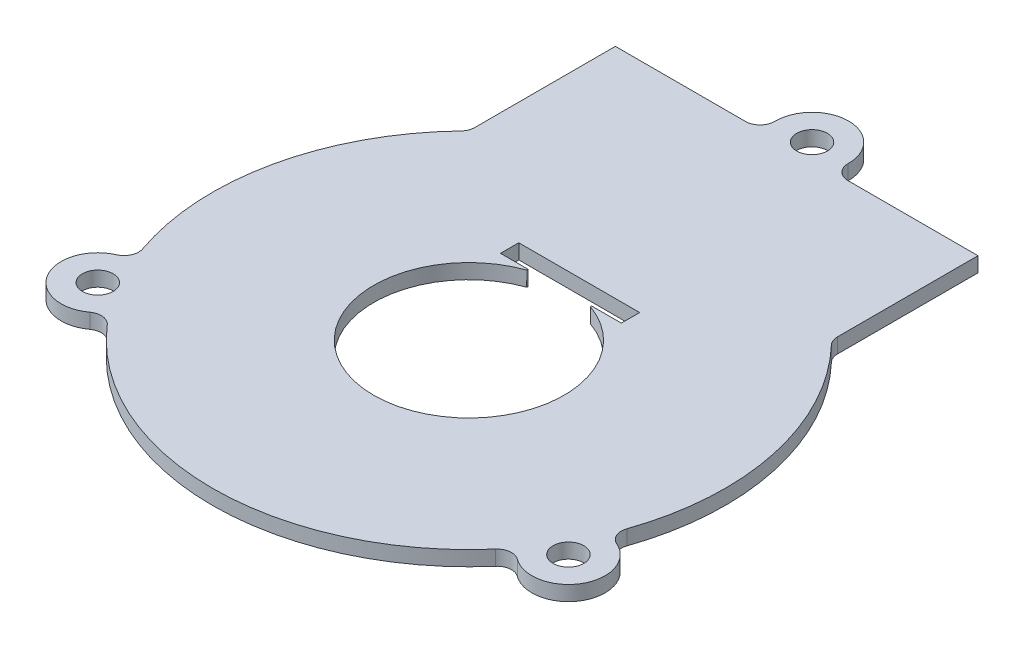
ISO-10303-21;
HEADER;
FILE_DESCRIPTION(('STEP AP214'),'2;1');
FILE_NAME('part.step','',(''),(''),'','','');
FILE_SCHEMA(('AUTOMOTIVE_DESIGN { 1 0 10303 214 1 1 1 1 }'));
ENDSEC;
DATA;
#1=APPLICATION_CONTEXT('core data for automotive mechanical design processes');
#2=APPLICATION_PROTOCOL_DEFINITION('international standard','automotive_design',2000,#1);
#3=PRODUCT_CONTEXT('',#1,'mechanical');
#4=PRODUCT('Part','Part','',(#3));
#5=PRODUCT_RELATED_PRODUCT_CATEGORY('part','',(#4));
#6=PRODUCT_DEFINITION_FORMATION('','',#4);
#7=PRODUCT_DEFINITION_CONTEXT('part definition',#1,'design');
#8=PRODUCT_DEFINITION('design','',#6,#7);
#9=PRODUCT_DEFINITION_SHAPE('','',#8);
#10=(LENGTH_UNIT() NAMED_UNIT(*) SI_UNIT(.MILLI.,.METRE.));
#11=(NAMED_UNIT(*) PLANE_ANGLE_UNIT() SI_UNIT($,.RADIAN.));
#12=(NAMED_UNIT(*) SI_UNIT($,.STERADIAN.) SOLID_ANGLE_UNIT());
#13=UNCERTAINTY_MEASURE_WITH_UNIT(LENGTH_MEASURE(1.E-05),#10,'distance_accuracy_value','');
#14=(GEOMETRIC_REPRESENTATION_CONTEXT(3) GLOBAL_UNCERTAINTY_ASSIGNED_CONTEXT((#13)) GLOBAL_UNIT_ASSIGNED_CONTEXT((#10,
#11,#12)) REPRESENTATION_CONTEXT('',''));
#15=CARTESIAN_POINT('',(0.,0.,0.));
#16=DIRECTION('',(0.,0.,1.));
#17=DIRECTION('',(1.,0.,0.));
#18=AXIS2_PLACEMENT_3D('',#15,#16,#17);
#19=CARTESIAN_POINT('',(0.,2.032,0.));
#20=DIRECTION('',(0.,1.,0.));
#21=DIRECTION('',(0.,0.,1.));
#22=AXIS2_PLACEMENT_3D('',#19,#20,#21);
#23=PLANE('',#22);
#24=CARTESIAN_POINT('',(-32.1480166138315,2.032,18.5087961651664));
#25=DIRECTION('',(0.,1.,0.));
#26=DIRECTION('',(0.,0.,1.));
#27=AXIS2_PLACEMENT_3D('',#24,#25,#26);
#28=CIRCLE('',#27,2.09999999999999);
#29=CARTESIAN_POINT('',(-32.1480166138315,2.032,20.6087961651664));
#30=VERTEX_POINT('',#29);
#31=EDGE_CURVE('E260',#30,#30,#28,.T.);
#32=ORIENTED_EDGE('',*,*,#31,.F.);
#33=EDGE_LOOP('',(#32));
#34=FACE_BOUND('',#33,.T.);
#35=DIRECTION('',(-3.02063810260161E-06,0.,-0.999999999995438));
#36=VECTOR('',#35,1.);
#37=CARTESIAN_POINT('',(-24.7478001128037,2.032,-24.7496745347634));
#38=LINE('',#37,#36);
#39=CARTESIAN_POINT('',(-24.7478025747881,2.032,-25.5647289504072));
#40=VERTEX_POINT('',#39);
#41=CARTESIAN_POINT('',(-24.7478605121482,2.032,-44.7452325826062));
#42=VERTEX_POINT('',#41);
#43=EDGE_CURVE('E309',#40,#42,#38,.T.);
#44=ORIENTED_EDGE('',*,*,#43,.F.);
#45=CARTESIAN_POINT('',(-26.747802574779,2.032,-25.564722909131));
#46=DIRECTION('',(0.,1.,0.));
#47=DIRECTION('',(0.,0.,1.));
#48=AXIS2_PLACEMENT_3D('',#45,#46,#47);
#49=CIRCLE('',#48,2.);
#50=CARTESIAN_POINT('',(-25.3019754085747,2.032,-24.1828459951239));
#51=VERTEX_POINT('',#50);
#52=EDGE_CURVE('E334',#40,#51,#49,.F.);
#53=ORIENTED_EDGE('',*,*,#52,.T.);
#54=CARTESIAN_POINT('',(0.,2.032,0.));
#55=DIRECTION('',(0.,1.,0.));
#56=DIRECTION('',(0.,0.,1.));
#57=AXIS2_PLACEMENT_3D('',#54,#55,#56);
#58=CIRCLE('',#57,35.);
#59=CARTESIAN_POINT('',(-33.072840065109,2.032,11.4537002766671));
#60=VERTEX_POINT('',#59);
#61=EDGE_CURVE('E320',#51,#60,#58,.T.);
#62=ORIENTED_EDGE('',*,*,#61,.T.);
#63=CARTESIAN_POINT('',(-34.9627166402581,2.032,12.1081974353338));
#64=DIRECTION('',(0.,1.,0.));
#65=DIRECTION('',(0.,0.,1.));
#66=AXIS2_PLACEMENT_3D('',#63,#64,#65);
#67=CIRCLE('',#66,2.);
#68=CARTESIAN_POINT('',(-34.1580179965192,2.032,13.9391698799011));
#69=VERTEX_POINT('',#68);
#70=EDGE_CURVE('E344',#60,#69,#67,.F.);
#71=ORIENTED_EDGE('',*,*,#70,.T.);
#72=CARTESIAN_POINT('',(-32.1464555555357,2.032,18.5161819435163));
#73=DIRECTION('',(0.,1.,0.));
#74=DIRECTION('',(0.,0.,1.));
#75=AXIS2_PLACEMENT_3D('',#72,#73,#74);
#76=CIRCLE('',#75,4.99954226749351);
#77=CARTESIAN_POINT('',(-29.1966357044392,2.032,22.5527628891349));
#78=VERTEX_POINT('',#77);
#79=EDGE_CURVE('E266',#69,#78,#76,.T.);
#80=ORIENTED_EDGE('',*,*,#79,.T.);
#81=CARTESIAN_POINT('',(-28.0165997358363,2.032,24.1675430948605));
#82=DIRECTION('',(0.,1.,0.));
#83=DIRECTION('',(0.,0.,1.));
#84=AXIS2_PLACEMENT_3D('',#81,#82,#83);
#85=CIRCLE('',#84,2.);
#86=CARTESIAN_POINT('',(-26.5021889393046,2.032,22.8611894140572));
#87=VERTEX_POINT('',#86);
#88=EDGE_CURVE('E355',#78,#87,#85,.F.);
#89=ORIENTED_EDGE('',*,*,#88,.T.);
#90=CARTESIAN_POINT('',(26.4887144081727,2.032,22.8768006723464));
#91=VERTEX_POINT('',#90);
#92=EDGE_CURVE('E324',#87,#91,#58,.T.);
#93=ORIENTED_EDGE('',*,*,#92,.T.);
#94=CARTESIAN_POINT('',(28.0023552314968,2.032,24.1840464250519));
#95=DIRECTION('',(0.,1.,0.));
#96=DIRECTION('',(0.,0.,1.));
#97=AXIS2_PLACEMENT_3D('',#94,#95,#96);
#98=CIRCLE('',#97,2.);
#99=CARTESIAN_POINT('',(29.184359284545,2.032,22.5707062815676));
#100=VERTEX_POINT('',#99);
#101=EDGE_CURVE('E363',#91,#100,#98,.F.);
#102=ORIENTED_EDGE('',*,*,#101,.T.);
#103=CARTESIAN_POINT('',(32.1364886347761,2.032,18.5412879583363));
#104=DIRECTION('',(0.,1.,0.));
#105=DIRECTION('',(0.,0.,1.));
#106=AXIS2_PLACEMENT_3D('',#103,#104,#105);
#107=CIRCLE('',#106,4.9951255964279);
#108=CARTESIAN_POINT('',(34.147287178261,2.032,13.9687647007018));
#109=VERTEX_POINT('',#108);
#110=EDGE_CURVE('E277',#100,#109,#107,.T.);
#111=ORIENTED_EDGE('',*,*,#110,.T.);
#112=CARTESIAN_POINT('',(34.9523914763083,2.032,12.1379705917791));
#113=DIRECTION('',(0.,1.,0.));
#114=DIRECTION('',(0.,0.,1.));
#115=AXIS2_PLACEMENT_3D('',#112,#113,#114);
#116=CIRCLE('',#115,2.);
#117=CARTESIAN_POINT('',(33.0630730181294,2.032,11.4818640733046));
#118=VERTEX_POINT('',#117);
#119=EDGE_CURVE('E374',#109,#118,#116,.F.);
#120=ORIENTED_EDGE('',*,*,#119,.T.);
#121=CARTESIAN_POINT('',(25.3018293128609,2.032,-24.1829988509046));
#122=VERTEX_POINT('',#121);
#123=EDGE_CURVE('E325',#118,#122,#58,.T.);
#124=ORIENTED_EDGE('',*,*,#123,.T.);
#125=CARTESIAN_POINT('',(26.7476481307387,2.032,-25.5648844995277));
#126=DIRECTION('',(0.,1.,0.));
#127=DIRECTION('',(0.,0.,1.));
#128=AXIS2_PLACEMENT_3D('',#125,#126,#127);
#129=CIRCLE('',#128,2.);
#130=CARTESIAN_POINT('',(24.7476481307478,2.032,-25.5648784582515));
#131=VERTEX_POINT('',#130);
#132=EDGE_CURVE('E381',#122,#131,#129,.F.);
#133=ORIENTED_EDGE('',*,*,#132,.T.);
#134=DIRECTION('',(-3.02063810260161E-06,0.,-0.999999999995438));
#135=VECTOR('',#134,1.);
#136=CARTESIAN_POINT('',(24.7476505927322,2.032,-24.7498240426077));
#137=LINE('',#136,#135);
#138=CARTESIAN_POINT('',(24.7475901933877,2.032,-44.7453820904505));
#139=VERTEX_POINT('',#138);
#140=EDGE_CURVE('E292',#131,#139,#137,.T.);
#141=ORIENTED_EDGE('',*,*,#140,.T.);
#142=DIRECTION('',(0.999999999995438,0.,-3.0206381024394E-06));
#143=VECTOR('',#142,1.);
#144=CARTESIAN_POINT('',(-24.7478605121482,2.032,-44.7452325826062));
#145=LINE('',#144,#143);
#146=CARTESIAN_POINT('',(6.99533660471705,2.032,-44.7453284673169));
#147=VERTEX_POINT('',#146);
#148=EDGE_CURVE('E305',#147,#139,#145,.T.);
#149=ORIENTED_EDGE('',*,*,#148,.F.);
#150=CARTESIAN_POINT('',(6.99533056344084,2.032,-46.7453284673078));
#151=DIRECTION('',(0.,1.,0.));
#152=DIRECTION('',(0.,0.,1.));
#153=AXIS2_PLACEMENT_3D('',#150,#151,#152);
#154=CIRCLE('',#153,2.);
#155=CARTESIAN_POINT('',(4.99551899083441,2.032,-46.7727815922561));
#156=VERTEX_POINT('',#155);
#157=EDGE_CURVE('E390',#147,#156,#154,.F.);
#158=ORIENTED_EDGE('',*,*,#157,.T.);
#159=CARTESIAN_POINT('',(0.,2.032,-46.8413593567393));
#160=DIRECTION('',(0.,1.,0.));
#161=DIRECTION('',(0.,0.,1.));
#162=AXIS2_PLACEMENT_3D('',#159,#160,#161);
#163=CIRCLE('',#162,4.99598968149142);
#164=CARTESIAN_POINT('',(-4.99551857644603,2.032,-46.7727514129473));
#165=VERTEX_POINT('',#164);
#166=EDGE_CURVE('E286',#156,#165,#163,.T.);
#167=ORIENTED_EDGE('',*,*,#166,.T.);
#168=CARTESIAN_POINT('',(-6.99532998316405,2.032,-46.7452862065854));
#169=DIRECTION('',(0.,1.,0.));
#170=DIRECTION('',(0.,0.,1.));
#171=AXIS2_PLACEMENT_3D('',#168,#169,#170);
#172=CIRCLE('',#171,2.);
#173=CARTESIAN_POINT('',(-6.99532394188785,2.032,-44.7452862065945));
#174=VERTEX_POINT('',#173);
#175=EDGE_CURVE('E401',#165,#174,#172,.F.);
#176=ORIENTED_EDGE('',*,*,#175,.T.);
#177=EDGE_CURVE('E306',#42,#174,#145,.T.);
#178=ORIENTED_EDGE('',*,*,#177,.F.);
#179=EDGE_LOOP('',(#44,#53,#62,#71,#80,#89,#93,#102,#111,#120,#124,#133,#141,#149,#158,#167,
#176,#178));
#180=FACE_BOUND('',#179,.T.);
#181=CARTESIAN_POINT('',(32.1247811991366,2.032,18.5356173256723));
#182=DIRECTION('',(0.,1.,0.));
#183=DIRECTION('',(0.,0.,1.));
#184=AXIS2_PLACEMENT_3D('',#181,#182,#183);
#185=CIRCLE('',#184,2.1);
#186=CARTESIAN_POINT('',(32.1247811991366,2.032,20.6356173256723));
#187=VERTEX_POINT('',#186);
#188=EDGE_CURVE('E271',#187,#187,#185,.T.);
#189=ORIENTED_EDGE('',*,*,#188,.F.);
#190=EDGE_LOOP('',(#189));
#191=FACE_BOUND('',#190,.T.);
#192=CARTESIAN_POINT('',(0.,2.032,-46.8413593567393));
#193=DIRECTION('',(0.,1.,0.));
#194=DIRECTION('',(0.,0.,1.));
#195=AXIS2_PLACEMENT_3D('',#192,#193,#194);
#196=CIRCLE('',#195,2.09605202456873);
#197=CARTESIAN_POINT('',(0.,2.032,-44.7453073321706));
#198=VERTEX_POINT('',#197);
#199=EDGE_CURVE('E282',#198,#198,#196,.T.);
#200=ORIENTED_EDGE('',*,*,#199,.F.);
#201=EDGE_LOOP('',(#200));
#202=FACE_BOUND('',#201,.T.);
#203=DIRECTION('',(-1.,0.,0.));
#204=VECTOR('',#203,1.);
#205=CARTESIAN_POINT('',(8.37780637247631,2.032,-12.4336030901751));
#206=LINE('',#205,#204);
#207=CARTESIAN_POINT('',(8.37780637247631,2.032,-12.4336030901751));
#208=VERTEX_POINT('',#207);
#209=CARTESIAN_POINT('',(4.41500111144089,2.032,-12.4336030901751));
#210=VERTEX_POINT('',#209);
#211=EDGE_CURVE('E243',#208,#210,#206,.T.);
#212=ORIENTED_EDGE('',*,*,#211,.T.);
#213=CARTESIAN_POINT('',(4.41500111144089,2.032,-12.3336030901751));
#214=DIRECTION('',(0.,1.,0.));
#215=DIRECTION('',(0.,0.,1.));
#216=AXIS2_PLACEMENT_3D('',#213,#214,#215);
#217=CIRCLE('',#216,0.1);
#218=CARTESIAN_POINT('',(4.38129881288027,2.032,-12.2394534482653));
#219=VERTEX_POINT('',#218);
#220=EDGE_CURVE('E408',#210,#219,#217,.T.);
#221=ORIENTED_EDGE('',*,*,#220,.T.);
#222=CARTESIAN_POINT('',(0.,2.032,0.));
#223=DIRECTION('',(0.,1.,0.));
#224=DIRECTION('',(0.,0.,1.));
#225=AXIS2_PLACEMENT_3D('',#222,#223,#224);
#226=CIRCLE('',#225,13.);
#227=CARTESIAN_POINT('',(-4.38129881288027,2.032,-12.2394534482653));
#228=VERTEX_POINT('',#227);
#229=EDGE_CURVE('E254',#228,#219,#226,.T.);
#230=ORIENTED_EDGE('',*,*,#229,.F.);
#231=CARTESIAN_POINT('',(-4.41500111144089,2.032,-12.3336030901751));
#232=DIRECTION('',(0.,1.,0.));
#233=DIRECTION('',(0.,0.,1.));
#234=AXIS2_PLACEMENT_3D('',#231,#232,#233);
#235=CIRCLE('',#234,0.1);
#236=CARTESIAN_POINT('',(-4.41500111144089,2.032,-12.4336030901751));
#237=VERTEX_POINT('',#236);
#238=EDGE_CURVE('E406',#228,#237,#235,.T.);
#239=ORIENTED_EDGE('',*,*,#238,.T.);
#240=CARTESIAN_POINT('',(-8.12219362752369,2.032,-12.4336030901751));
#241=VERTEX_POINT('',#240);
#242=EDGE_CURVE('E240',#237,#241,#206,.T.);
#243=ORIENTED_EDGE('',*,*,#242,.T.);
#244=DIRECTION('',(0.,0.,-1.));
#245=VECTOR('',#244,1.);
#246=CARTESIAN_POINT('',(-8.12219362752369,2.032,-12.4336030901751));
#247=LINE('',#246,#245);
#248=CARTESIAN_POINT('',(-8.12219362752369,2.032,-14.9336030901751));
#249=VERTEX_POINT('',#248);
#250=EDGE_CURVE('E221',#241,#249,#247,.T.);
#251=ORIENTED_EDGE('',*,*,#250,.T.);
#252=DIRECTION('',(-1.,0.,0.));
#253=VECTOR('',#252,1.);
#254=CARTESIAN_POINT('',(8.37780637247631,2.032,-14.9336030901751));
#255=LINE('',#254,#253);
#256=CARTESIAN_POINT('',(8.37780637247631,2.032,-14.9336030901751));
#257=VERTEX_POINT('',#256);
#258=EDGE_CURVE('E230',#257,#249,#255,.T.);
#259=ORIENTED_EDGE('',*,*,#258,.F.);
#260=DIRECTION('',(0.,0.,-1.));
#261=VECTOR('',#260,1.);
#262=CARTESIAN_POINT('',(8.37780637247631,2.032,-12.4336030901751));
#263=LINE('',#262,#261);
#264=EDGE_CURVE('E227',#208,#257,#263,.T.);
#265=ORIENTED_EDGE('',*,*,#264,.F.);
#266=EDGE_LOOP('',(#212,#221,#230,#239,#243,#251,#259,#265));
#267=FACE_BOUND('',#266,.T.);
#268=ADVANCED_FACE('F43',(#34,#180,#191,#202,#267),#23,.T.);
#269=CARTESIAN_POINT('',(0.,0.,0.));
#270=DIRECTION('',(0.,1.,0.));
#271=DIRECTION('',(0.,0.,1.));
#272=AXIS2_PLACEMENT_3D('',#269,#270,#271);
#273=PLANE('',#272);
#274=CARTESIAN_POINT('',(0.,0.,0.));
#275=DIRECTION('',(0.,1.,0.));
#276=DIRECTION('',(0.,0.,1.));
#277=AXIS2_PLACEMENT_3D('',#274,#275,#276);
#278=CIRCLE('',#277,35.);
#279=CARTESIAN_POINT('',(-26.5021889393046,0.,22.8611894140572));
#280=VERTEX_POINT('',#279);
#281=CARTESIAN_POINT('',(26.4887144081727,0.,22.8768006723464));
#282=VERTEX_POINT('',#281);
#283=EDGE_CURVE('E329',#280,#282,#278,.T.);
#284=ORIENTED_EDGE('',*,*,#283,.F.);
#285=CARTESIAN_POINT('',(-28.0165997358363,0.,24.1675430948605));
#286=DIRECTION('',(0.,1.,0.));
#287=DIRECTION('',(0.,0.,1.));
#288=AXIS2_PLACEMENT_3D('',#285,#286,#287);
#289=CIRCLE('',#288,2.);
#290=CARTESIAN_POINT('',(-29.1966357044392,0.,22.5527628891349));
#291=VERTEX_POINT('',#290);
#292=EDGE_CURVE('E353',#280,#291,#289,.T.);
#293=ORIENTED_EDGE('',*,*,#292,.T.);
#294=CARTESIAN_POINT('',(-32.1464555555357,0.,18.5161819435163));
#295=DIRECTION('',(0.,1.,0.));
#296=DIRECTION('',(0.,0.,1.));
#297=AXIS2_PLACEMENT_3D('',#294,#295,#296);
#298=CIRCLE('',#297,4.99954226749351);
#299=CARTESIAN_POINT('',(-34.1580179965192,0.,13.9391698799011));
#300=VERTEX_POINT('',#299);
#301=EDGE_CURVE('E269',#291,#300,#298,.F.);
#302=ORIENTED_EDGE('',*,*,#301,.T.);
#303=CARTESIAN_POINT('',(-34.9627166402581,0.,12.1081974353338));
#304=DIRECTION('',(0.,1.,0.));
#305=DIRECTION('',(0.,0.,1.));
#306=AXIS2_PLACEMENT_3D('',#303,#304,#305);
#307=CIRCLE('',#306,2.);
#308=CARTESIAN_POINT('',(-33.072840065109,0.,11.4537002766671));
#309=VERTEX_POINT('',#308);
#310=EDGE_CURVE('E346',#300,#309,#307,.T.);
#311=ORIENTED_EDGE('',*,*,#310,.T.);
#312=CARTESIAN_POINT('',(-25.3019754085747,0.,-24.1828459951239));
#313=VERTEX_POINT('',#312);
#314=EDGE_CURVE('E326',#313,#309,#278,.T.);
#315=ORIENTED_EDGE('',*,*,#314,.F.);
#316=CARTESIAN_POINT('',(-26.747802574779,0.,-25.564722909131));
#317=DIRECTION('',(0.,1.,0.));
#318=DIRECTION('',(0.,0.,1.));
#319=AXIS2_PLACEMENT_3D('',#316,#317,#318);
#320=CIRCLE('',#319,2.);
#321=CARTESIAN_POINT('',(-24.7478025747881,0.,-25.5647289504072));
#322=VERTEX_POINT('',#321);
#323=EDGE_CURVE('E336',#313,#322,#320,.T.);
#324=ORIENTED_EDGE('',*,*,#323,.T.);
#325=DIRECTION('',(3.02063810260161E-06,0.,0.999999999995438));
#326=VECTOR('',#325,1.);
#327=CARTESIAN_POINT('',(-24.7478001128037,0.,-24.7496745347634));
#328=LINE('',#327,#326);
#329=CARTESIAN_POINT('',(-24.7478605121482,0.,-44.7452325826062));
#330=VERTEX_POINT('',#329);
#331=EDGE_CURVE('E295',#330,#322,#328,.T.);
#332=ORIENTED_EDGE('',*,*,#331,.F.);
#333=DIRECTION('',(-0.999999999995438,0.,3.0206381024394E-06));
#334=VECTOR('',#333,1.);
#335=CARTESIAN_POINT('',(-24.7478605121482,0.,-44.7452325826062));
#336=LINE('',#335,#334);
#337=CARTESIAN_POINT('',(-6.99532394188785,0.,-44.7452862065945));
#338=VERTEX_POINT('',#337);
#339=EDGE_CURVE('E315',#338,#330,#336,.T.);
#340=ORIENTED_EDGE('',*,*,#339,.F.);
#341=CARTESIAN_POINT('',(-6.99532998316405,0.,-46.7452862065854));
#342=DIRECTION('',(0.,1.,0.));
#343=DIRECTION('',(0.,0.,1.));
#344=AXIS2_PLACEMENT_3D('',#341,#342,#343);
#345=CIRCLE('',#344,2.);
#346=CARTESIAN_POINT('',(-4.99551857644603,0.,-46.7727514129473));
#347=VERTEX_POINT('',#346);
#348=EDGE_CURVE('E399',#338,#347,#345,.T.);
#349=ORIENTED_EDGE('',*,*,#348,.T.);
#350=CARTESIAN_POINT('',(0.,0.,-46.8413593567393));
#351=DIRECTION('',(0.,1.,0.));
#352=DIRECTION('',(0.,0.,1.));
#353=AXIS2_PLACEMENT_3D('',#350,#351,#352);
#354=CIRCLE('',#353,4.99598968149142);
#355=CARTESIAN_POINT('',(4.99551899083441,0.,-46.7727815922561));
#356=VERTEX_POINT('',#355);
#357=EDGE_CURVE('E289',#356,#347,#354,.T.);
#358=ORIENTED_EDGE('',*,*,#357,.F.);
#359=CARTESIAN_POINT('',(6.99533056344084,0.,-46.7453284673078));
#360=DIRECTION('',(0.,1.,0.));
#361=DIRECTION('',(0.,0.,1.));
#362=AXIS2_PLACEMENT_3D('',#359,#360,#361);
#363=CIRCLE('',#362,2.);
#364=CARTESIAN_POINT('',(6.99533660471705,0.,-44.7453284673169));
#365=VERTEX_POINT('',#364);
#366=EDGE_CURVE('E392',#356,#365,#363,.T.);
#367=ORIENTED_EDGE('',*,*,#366,.T.);
#368=CARTESIAN_POINT('',(24.7475901933877,0.,-44.7453820904505));
#369=VERTEX_POINT('',#368);
#370=EDGE_CURVE('E299',#369,#365,#336,.T.);
#371=ORIENTED_EDGE('',*,*,#370,.F.);
#372=DIRECTION('',(3.02063810260161E-06,0.,0.999999999995438));
#373=VECTOR('',#372,1.);
#374=CARTESIAN_POINT('',(24.7476505927322,0.,-24.7498240426077));
#375=LINE('',#374,#373);
#376=CARTESIAN_POINT('',(24.7476481307478,0.,-25.5648784582515));
#377=VERTEX_POINT('',#376);
#378=EDGE_CURVE('E298',#369,#377,#375,.T.);
#379=ORIENTED_EDGE('',*,*,#378,.T.);
#380=CARTESIAN_POINT('',(26.7476481307387,0.,-25.5648844995277));
#381=DIRECTION('',(0.,1.,0.));
#382=DIRECTION('',(0.,0.,1.));
#383=AXIS2_PLACEMENT_3D('',#380,#381,#382);
#384=CIRCLE('',#383,2.);
#385=CARTESIAN_POINT('',(25.3018293128609,0.,-24.1829988509046));
#386=VERTEX_POINT('',#385);
#387=EDGE_CURVE('E383',#377,#386,#384,.T.);
#388=ORIENTED_EDGE('',*,*,#387,.T.);
#389=CARTESIAN_POINT('',(33.0630730181294,0.,11.4818640733046));
#390=VERTEX_POINT('',#389);
#391=EDGE_CURVE('E302',#390,#386,#278,.T.);
#392=ORIENTED_EDGE('',*,*,#391,.F.);
#393=CARTESIAN_POINT('',(34.9523914763083,0.,12.1379705917791));
#394=DIRECTION('',(0.,1.,0.));
#395=DIRECTION('',(0.,0.,1.));
#396=AXIS2_PLACEMENT_3D('',#393,#394,#395);
#397=CIRCLE('',#396,2.);
#398=CARTESIAN_POINT('',(34.147287178261,0.,13.9687647007018));
#399=VERTEX_POINT('',#398);
#400=EDGE_CURVE('E372',#390,#399,#397,.T.);
#401=ORIENTED_EDGE('',*,*,#400,.T.);
#402=CARTESIAN_POINT('',(32.1364886347761,0.,18.5412879583363));
#403=DIRECTION('',(0.,1.,0.));
#404=DIRECTION('',(0.,0.,1.));
#405=AXIS2_PLACEMENT_3D('',#402,#403,#404);
#406=CIRCLE('',#405,4.9951255964279);
#407=CARTESIAN_POINT('',(29.184359284545,0.,22.5707062815676));
#408=VERTEX_POINT('',#407);
#409=EDGE_CURVE('E280',#399,#408,#406,.F.);
#410=ORIENTED_EDGE('',*,*,#409,.T.);
#411=CARTESIAN_POINT('',(28.0023552314968,0.,24.1840464250519));
#412=DIRECTION('',(0.,1.,0.));
#413=DIRECTION('',(0.,0.,1.));
#414=AXIS2_PLACEMENT_3D('',#411,#412,#413);
#415=CIRCLE('',#414,2.);
#416=EDGE_CURVE('E365',#408,#282,#415,.T.);
#417=ORIENTED_EDGE('',*,*,#416,.T.);
#418=EDGE_LOOP('',(#284,#293,#302,#311,#315,#324,#332,#340,#349,#358,#367,#371,#379,#388,#392,
#401,#410,#417));
#419=FACE_BOUND('',#418,.T.);
#420=CARTESIAN_POINT('',(0.,0.,-46.8413593567393));
#421=DIRECTION('',(0.,1.,0.));
#422=DIRECTION('',(0.,0.,1.));
#423=AXIS2_PLACEMENT_3D('',#420,#421,#422);
#424=CIRCLE('',#423,2.09605202456873);
#425=CARTESIAN_POINT('',(0.,0.,-44.7453073321706));
#426=VERTEX_POINT('',#425);
#427=EDGE_CURVE('E283',#426,#426,#424,.T.);
#428=ORIENTED_EDGE('',*,*,#427,.T.);
#429=EDGE_LOOP('',(#428));
#430=FACE_BOUND('',#429,.T.);
#431=CARTESIAN_POINT('',(32.1247811991366,0.,18.5356173256723));
#432=DIRECTION('',(0.,1.,0.));
#433=DIRECTION('',(0.,0.,1.));
#434=AXIS2_PLACEMENT_3D('',#431,#432,#433);
#435=CIRCLE('',#434,2.1);
#436=CARTESIAN_POINT('',(32.1247811991366,0.,20.6356173256723));
#437=VERTEX_POINT('',#436);
#438=EDGE_CURVE('E274',#437,#437,#435,.T.);
#439=ORIENTED_EDGE('',*,*,#438,.T.);
#440=EDGE_LOOP('',(#439));
#441=FACE_BOUND('',#440,.T.);
#442=CARTESIAN_POINT('',(-32.1480166138315,0.,18.5087961651664));
#443=DIRECTION('',(0.,1.,0.));
#444=DIRECTION('',(0.,0.,1.));
#445=AXIS2_PLACEMENT_3D('',#442,#443,#444);
#446=CIRCLE('',#445,2.1);
#447=CARTESIAN_POINT('',(-32.1480166138315,0.,20.6087961651664));
#448=VERTEX_POINT('',#447);
#449=EDGE_CURVE('E263',#448,#448,#446,.T.);
#450=ORIENTED_EDGE('',*,*,#449,.T.);
#451=EDGE_LOOP('',(#450));
#452=FACE_BOUND('',#451,.T.);
#453=CARTESIAN_POINT('',(0.,0.,0.));
#454=DIRECTION('',(0.,1.,0.));
#455=DIRECTION('',(0.,0.,1.));
#456=AXIS2_PLACEMENT_3D('',#453,#454,#455);
#457=CIRCLE('',#456,13.);
#458=CARTESIAN_POINT('',(4.38129881288027,0.,-12.2394534482653));
#459=VERTEX_POINT('',#458);
#460=CARTESIAN_POINT('',(-4.38129881288027,0.,-12.2394534482653));
#461=VERTEX_POINT('',#460);
#462=EDGE_CURVE('E257',#459,#461,#457,.F.);
#463=ORIENTED_EDGE('',*,*,#462,.F.);
#464=CARTESIAN_POINT('',(4.41500111144089,0.,-12.3336030901751));
#465=DIRECTION('',(0.,1.,0.));
#466=DIRECTION('',(0.,0.,1.));
#467=AXIS2_PLACEMENT_3D('',#464,#465,#466);
#468=CIRCLE('',#467,0.1);
#469=CARTESIAN_POINT('',(4.41500111144089,0.,-12.4336030901751));
#470=VERTEX_POINT('',#469);
#471=EDGE_CURVE('E51',#459,#470,#468,.F.);
#472=ORIENTED_EDGE('',*,*,#471,.T.);
#473=DIRECTION('',(1.,0.,0.));
#474=VECTOR('',#473,1.);
#475=CARTESIAN_POINT('',(8.37780637247631,0.,-12.4336030901751));
#476=LINE('',#475,#474);
#477=CARTESIAN_POINT('',(8.37780637247631,0.,-12.4336030901751));
#478=VERTEX_POINT('',#477);
#479=EDGE_CURVE('E253',#470,#478,#476,.T.);
#480=ORIENTED_EDGE('',*,*,#479,.T.);
#481=DIRECTION('',(0.,0.,1.));
#482=VECTOR('',#481,1.);
#483=CARTESIAN_POINT('',(8.37780637247631,0.,-12.4336030901751));
#484=LINE('',#483,#482);
#485=CARTESIAN_POINT('',(8.37780637247631,0.,-14.9336030901751));
#486=VERTEX_POINT('',#485);
#487=EDGE_CURVE('E435',#486,#478,#484,.T.);
#488=ORIENTED_EDGE('',*,*,#487,.F.);
#489=DIRECTION('',(1.,0.,0.));
#490=VECTOR('',#489,1.);
#491=CARTESIAN_POINT('',(8.37780637247631,0.,-14.9336030901751));
#492=LINE('',#491,#490);
#493=CARTESIAN_POINT('',(-8.12219362752369,0.,-14.9336030901751));
#494=VERTEX_POINT('',#493);
#495=EDGE_CURVE('E258',#494,#486,#492,.T.);
#496=ORIENTED_EDGE('',*,*,#495,.F.);
#497=DIRECTION('',(0.,0.,1.));
#498=VECTOR('',#497,1.);
#499=CARTESIAN_POINT('',(-8.12219362752369,0.,-12.4336030901751));
#500=LINE('',#499,#498);
#501=CARTESIAN_POINT('',(-8.12219362752369,0.,-12.4336030901751));
#502=VERTEX_POINT('',#501);
#503=EDGE_CURVE('E223',#494,#502,#500,.T.);
#504=ORIENTED_EDGE('',*,*,#503,.T.);
#505=CARTESIAN_POINT('',(-4.41500111144089,0.,-12.4336030901751));
#506=VERTEX_POINT('',#505);
#507=EDGE_CURVE('E426',#502,#506,#476,.T.);
#508=ORIENTED_EDGE('',*,*,#507,.T.);
#509=CARTESIAN_POINT('',(-4.41500111144089,0.,-12.3336030901751));
#510=DIRECTION('',(0.,1.,0.));
#511=DIRECTION('',(0.,0.,1.));
#512=AXIS2_PLACEMENT_3D('',#509,#510,#511);
#513=CIRCLE('',#512,0.1);
#514=EDGE_CURVE('E58',#506,#461,#513,.F.);
#515=ORIENTED_EDGE('',*,*,#514,.T.);
#516=EDGE_LOOP('',(#463,#472,#480,#488,#496,#504,#508,#515));
#517=FACE_BOUND('',#516,.T.);
#518=ADVANCED_FACE('F416',(#419,#430,#441,#452,#517),#273,.F.);
#519=CARTESIAN_POINT('',(0.,-36.7695526217005,0.));
#520=DIRECTION('',(0.,1.,0.));
#521=DIRECTION('',(0.,0.,1.));
#522=AXIS2_PLACEMENT_3D('',#519,#520,#521);
#523=CYLINDRICAL_SURFACE('',#522,13.);
#524=ORIENTED_EDGE('',*,*,#229,.T.);
#525=DIRECTION('',(0.,1.,0.));
#526=VECTOR('',#525,1.);
#527=CARTESIAN_POINT('',(4.38129881288027,-36.7695526217005,-12.2394534482653));
#528=LINE('',#527,#526);
#529=EDGE_CURVE('E412',#219,#459,#528,.F.);
#530=ORIENTED_EDGE('',*,*,#529,.T.);
#531=ORIENTED_EDGE('',*,*,#462,.T.);
#532=DIRECTION('',(0.,1.,0.));
#533=VECTOR('',#532,1.);
#534=CARTESIAN_POINT('',(-4.38129881288027,-36.7695526217005,-12.2394534482653));
#535=LINE('',#534,#533);
#536=EDGE_CURVE('E410',#461,#228,#535,.T.);
#537=ORIENTED_EDGE('',*,*,#536,.T.);
#538=EDGE_LOOP('',(#524,#530,#531,#537));
#539=FACE_BOUND('',#538,.T.);
#540=ADVANCED_FACE('F432',(#539),#523,.F.);
#541=CARTESIAN_POINT('',(0.,2.032,0.));
#542=DIRECTION('',(0.,-1.,0.));
#543=DIRECTION('',(0.,0.,-1.));
#544=AXIS2_PLACEMENT_3D('',#541,#542,#543);
#545=CYLINDRICAL_SURFACE('',#544,35.);
#546=ORIENTED_EDGE('',*,*,#314,.T.);
#547=DIRECTION('',(0.,-1.,0.));
#548=VECTOR('',#547,1.);
#549=CARTESIAN_POINT('',(-33.072840065109,2.032,11.4537002766671));
#550=LINE('',#549,#548);
#551=EDGE_CURVE('E338',#309,#60,#550,.F.);
#552=ORIENTED_EDGE('',*,*,#551,.T.);
#553=ORIENTED_EDGE('',*,*,#61,.F.);
#554=DIRECTION('',(0.,-1.,0.));
#555=VECTOR('',#554,1.);
#556=CARTESIAN_POINT('',(-25.3019754085747,2.032,-24.1828459951239));
#557=LINE('',#556,#555);
#558=EDGE_CURVE('E332',#51,#313,#557,.T.);
#559=ORIENTED_EDGE('',*,*,#558,.T.);
#560=EDGE_LOOP('',(#546,#552,#553,#559));
#561=FACE_BOUND('',#560,.T.);
#562=ADVANCED_FACE('F468',(#561),#545,.T.);
#563=ORIENTED_EDGE('',*,*,#283,.T.);
#564=DIRECTION('',(0.,-1.,0.));
#565=VECTOR('',#564,1.);
#566=CARTESIAN_POINT('',(26.4887144081727,2.032,22.8768006723464));
#567=LINE('',#566,#565);
#568=EDGE_CURVE('E357',#282,#91,#567,.F.);
#569=ORIENTED_EDGE('',*,*,#568,.T.);
#570=ORIENTED_EDGE('',*,*,#92,.F.);
#571=DIRECTION('',(0.,-1.,0.));
#572=VECTOR('',#571,1.);
#573=CARTESIAN_POINT('',(-26.5021889393046,2.032,22.8611894140572));
#574=LINE('',#573,#572);
#575=EDGE_CURVE('E348',#87,#280,#574,.T.);
#576=ORIENTED_EDGE('',*,*,#575,.T.);
#577=EDGE_LOOP('',(#563,#569,#570,#576));
#578=FACE_BOUND('',#577,.T.);
#579=ADVANCED_FACE('F469',(#578),#545,.T.);
#580=CARTESIAN_POINT('',(-24.7478605121482,-53.381962685779,-44.7452325826062));
#581=DIRECTION('',(3.0206381024394E-06,0.,0.999999999995438));
#582=DIRECTION('',(0.999999999995438,0.,-3.0206381024394E-06));
#583=AXIS2_PLACEMENT_3D('',#580,#581,#582);
#584=PLANE('',#583);
#585=ORIENTED_EDGE('',*,*,#177,.T.);
#586=DIRECTION('',(0.,1.,0.));
#587=VECTOR('',#586,1.);
#588=CARTESIAN_POINT('',(-6.99532394188785,-53.381962685779,-44.7452862065945));
#589=LINE('',#588,#587);
#590=EDGE_CURVE('E394',#174,#338,#589,.F.);
#591=ORIENTED_EDGE('',*,*,#590,.T.);
#592=ORIENTED_EDGE('',*,*,#339,.T.);
#593=DIRECTION('',(0.,1.,0.));
#594=VECTOR('',#593,1.);
#595=CARTESIAN_POINT('',(-24.7478605121482,-53.381962685779,-44.7452325826062));
#596=LINE('',#595,#594);
#597=EDGE_CURVE('E312',#330,#42,#596,.T.);
#598=ORIENTED_EDGE('',*,*,#597,.T.);
#599=EDGE_LOOP('',(#585,#591,#592,#598));
#600=FACE_BOUND('',#599,.T.);
#601=ADVANCED_FACE('F466',(#600),#584,.F.);
#602=ORIENTED_EDGE('',*,*,#391,.T.);
#603=DIRECTION('',(0.,-1.,0.));
#604=VECTOR('',#603,1.);
#605=CARTESIAN_POINT('',(25.3018293128609,2.032,-24.1829988509046));
#606=LINE('',#605,#604);
#607=EDGE_CURVE('E376',#386,#122,#606,.F.);
#608=ORIENTED_EDGE('',*,*,#607,.T.);
#609=ORIENTED_EDGE('',*,*,#123,.F.);
#610=DIRECTION('',(0.,-1.,0.));
#611=VECTOR('',#610,1.);
#612=CARTESIAN_POINT('',(33.0630730181294,2.032,11.4818640733046));
#613=LINE('',#612,#611);
#614=EDGE_CURVE('E367',#118,#390,#613,.T.);
#615=ORIENTED_EDGE('',*,*,#614,.T.);
#616=EDGE_LOOP('',(#602,#608,#609,#615));
#617=FACE_BOUND('',#616,.T.);
#618=ADVANCED_FACE('F462',(#617),#545,.T.);
#619=ORIENTED_EDGE('',*,*,#370,.T.);
#620=DIRECTION('',(0.,1.,0.));
#621=VECTOR('',#620,1.);
#622=CARTESIAN_POINT('',(6.99533660471705,-53.381962685779,-44.7453284673169));
#623=LINE('',#622,#621);
#624=EDGE_CURVE('E385',#365,#147,#623,.T.);
#625=ORIENTED_EDGE('',*,*,#624,.T.);
#626=ORIENTED_EDGE('',*,*,#148,.T.);
#627=DIRECTION('',(0.,1.,0.));
#628=VECTOR('',#627,1.);
#629=CARTESIAN_POINT('',(24.7475901933877,-53.381962685779,-44.7453820904505));
#630=LINE('',#629,#628);
#631=EDGE_CURVE('E311',#369,#139,#630,.T.);
#632=ORIENTED_EDGE('',*,*,#631,.F.);
#633=EDGE_LOOP('',(#619,#625,#626,#632));
#634=FACE_BOUND('',#633,.T.);
#635=ADVANCED_FACE('F465',(#634),#584,.F.);
#636=CARTESIAN_POINT('',(-24.7478001128037,-53.381962685779,-24.7496745347634));
#637=DIRECTION('',(0.999999999995438,0.,-3.02063810260161E-06));
#638=DIRECTION('',(-3.02063810260161E-06,0.,-0.999999999995438));
#639=AXIS2_PLACEMENT_3D('',#636,#637,#638);
#640=PLANE('',#639);
#641=ORIENTED_EDGE('',*,*,#331,.T.);
#642=DIRECTION('',(0.,1.,0.));
#643=VECTOR('',#642,1.);
#644=CARTESIAN_POINT('',(-24.7478025747881,2.032,-25.5647289504072));
#645=LINE('',#644,#643);
#646=EDGE_CURVE('E323',#322,#40,#645,.T.);
#647=ORIENTED_EDGE('',*,*,#646,.T.);
#648=ORIENTED_EDGE('',*,*,#43,.T.);
#649=ORIENTED_EDGE('',*,*,#597,.F.);
#650=EDGE_LOOP('',(#641,#647,#648,#649));
#651=FACE_BOUND('',#650,.T.);
#652=ADVANCED_FACE('F611',(#651),#640,.F.);
#653=CARTESIAN_POINT('',(24.7476505927322,-53.381962685779,-24.7498240426077));
#654=DIRECTION('',(0.999999999995438,0.,-3.02063810260161E-06));
#655=DIRECTION('',(-3.02063810260161E-06,0.,-0.999999999995438));
#656=AXIS2_PLACEMENT_3D('',#653,#654,#655);
#657=PLANE('',#656);
#658=ORIENTED_EDGE('',*,*,#140,.F.);
#659=DIRECTION('',(0.,-1.,0.));
#660=VECTOR('',#659,1.);
#661=CARTESIAN_POINT('',(24.7476481307478,-53.381962685779,-25.5648784582515));
#662=LINE('',#661,#660);
#663=EDGE_CURVE('E379',#131,#377,#662,.T.);
#664=ORIENTED_EDGE('',*,*,#663,.T.);
#665=ORIENTED_EDGE('',*,*,#378,.F.);
#666=ORIENTED_EDGE('',*,*,#631,.T.);
#667=EDGE_LOOP('',(#658,#664,#665,#666));
#668=FACE_BOUND('',#667,.T.);
#669=ADVANCED_FACE('F459',(#668),#657,.T.);
#670=CARTESIAN_POINT('',(0.,0.,-46.8413593567393));
#671=DIRECTION('',(0.,1.,0.));
#672=DIRECTION('',(0.,0.,1.));
#673=AXIS2_PLACEMENT_3D('',#670,#671,#672);
#674=CYLINDRICAL_SURFACE('',#673,4.99598968149142);
#675=ORIENTED_EDGE('',*,*,#357,.T.);
#676=DIRECTION('',(0.,1.,0.));
#677=VECTOR('',#676,1.);
#678=CARTESIAN_POINT('',(-4.99551857644604,0.,-46.7727514129473));
#679=LINE('',#678,#677);
#680=EDGE_CURVE('E397',#347,#165,#679,.T.);
#681=ORIENTED_EDGE('',*,*,#680,.T.);
#682=ORIENTED_EDGE('',*,*,#166,.F.);
#683=DIRECTION('',(0.,1.,0.));
#684=VECTOR('',#683,1.);
#685=CARTESIAN_POINT('',(4.99551899083441,0.,-46.7727815922561));
#686=LINE('',#685,#684);
#687=EDGE_CURVE('E388',#156,#356,#686,.F.);
#688=ORIENTED_EDGE('',*,*,#687,.T.);
#689=EDGE_LOOP('',(#675,#681,#682,#688));
#690=FACE_BOUND('',#689,.T.);
#691=ADVANCED_FACE('F577',(#690),#674,.T.);
#692=CARTESIAN_POINT('',(0.,0.,-46.8413593567393));
#693=DIRECTION('',(0.,1.,0.));
#694=DIRECTION('',(0.,0.,1.));
#695=AXIS2_PLACEMENT_3D('',#692,#693,#694);
#696=CYLINDRICAL_SURFACE('',#695,2.09605202456873);
#697=ORIENTED_EDGE('',*,*,#199,.T.);
#698=EDGE_LOOP('',(#697));
#699=FACE_BOUND('',#698,.T.);
#700=ORIENTED_EDGE('',*,*,#427,.F.);
#701=EDGE_LOOP('',(#700));
#702=FACE_BOUND('',#701,.T.);
#703=ADVANCED_FACE('F582',(#699,#702),#696,.F.);
#704=CARTESIAN_POINT('',(32.1364886347761,-14.1283487284507,18.5412879583363));
#705=DIRECTION('',(0.,1.,0.));
#706=DIRECTION('',(0.,0.,1.));
#707=AXIS2_PLACEMENT_3D('',#704,#705,#706);
#708=CYLINDRICAL_SURFACE('',#707,4.9951255964279);
#709=ORIENTED_EDGE('',*,*,#409,.F.);
#710=DIRECTION('',(0.,1.,0.));
#711=VECTOR('',#710,1.);
#712=CARTESIAN_POINT('',(34.147287178261,-14.1283487284507,13.9687647007018));
#713=LINE('',#712,#711);
#714=EDGE_CURVE('E370',#399,#109,#713,.T.);
#715=ORIENTED_EDGE('',*,*,#714,.T.);
#716=ORIENTED_EDGE('',*,*,#110,.F.);
#717=DIRECTION('',(0.,1.,0.));
#718=VECTOR('',#717,1.);
#719=CARTESIAN_POINT('',(29.184359284545,-14.1283487284507,22.5707062815676));
#720=LINE('',#719,#718);
#721=EDGE_CURVE('E360',#100,#408,#720,.F.);
#722=ORIENTED_EDGE('',*,*,#721,.T.);
#723=EDGE_LOOP('',(#709,#715,#716,#722));
#724=FACE_BOUND('',#723,.T.);
#725=ADVANCED_FACE('F642',(#724),#708,.T.);
#726=CARTESIAN_POINT('',(32.1247811991366,2.032,18.5356173256723));
#727=DIRECTION('',(0.,1.,0.));
#728=DIRECTION('',(0.,0.,1.));
#729=AXIS2_PLACEMENT_3D('',#726,#727,#728);
#730=CYLINDRICAL_SURFACE('',#729,2.1);
#731=ORIENTED_EDGE('',*,*,#438,.F.);
#732=EDGE_LOOP('',(#731));
#733=FACE_BOUND('',#732,.T.);
#734=ORIENTED_EDGE('',*,*,#188,.T.);
#735=EDGE_LOOP('',(#734));
#736=FACE_BOUND('',#735,.T.);
#737=ADVANCED_FACE('F647',(#733,#736),#730,.F.);
#738=CARTESIAN_POINT('',(-32.1464555555357,-14.1408409606937,18.5161819435163));
#739=DIRECTION('',(0.,1.,0.));
#740=DIRECTION('',(0.,0.,1.));
#741=AXIS2_PLACEMENT_3D('',#738,#739,#740);
#742=CYLINDRICAL_SURFACE('',#741,4.99954226749351);
#743=ORIENTED_EDGE('',*,*,#301,.F.);
#744=DIRECTION('',(0.,1.,0.));
#745=VECTOR('',#744,1.);
#746=CARTESIAN_POINT('',(-29.1966357044392,-14.1408409606937,22.5527628891349));
#747=LINE('',#746,#745);
#748=EDGE_CURVE('E351',#291,#78,#747,.T.);
#749=ORIENTED_EDGE('',*,*,#748,.T.);
#750=ORIENTED_EDGE('',*,*,#79,.F.);
#751=DIRECTION('',(0.,1.,0.));
#752=VECTOR('',#751,1.);
#753=CARTESIAN_POINT('',(-34.1580179965192,-14.1408409606937,13.9391698799011));
#754=LINE('',#753,#752);
#755=EDGE_CURVE('E341',#69,#300,#754,.F.);
#756=ORIENTED_EDGE('',*,*,#755,.T.);
#757=EDGE_LOOP('',(#743,#749,#750,#756));
#758=FACE_BOUND('',#757,.T.);
#759=ADVANCED_FACE('F674',(#758),#742,.T.);
#760=CARTESIAN_POINT('',(-32.1480166138315,2.032,18.5087961651664));
#761=DIRECTION('',(0.,1.,0.));
#762=DIRECTION('',(0.,0.,1.));
#763=AXIS2_PLACEMENT_3D('',#760,#761,#762);
#764=CYLINDRICAL_SURFACE('',#763,2.09999999999999);
#765=ORIENTED_EDGE('',*,*,#449,.F.);
#766=EDGE_LOOP('',(#765));
#767=FACE_BOUND('',#766,.T.);
#768=ORIENTED_EDGE('',*,*,#31,.T.);
#769=EDGE_LOOP('',(#768));
#770=FACE_BOUND('',#769,.T.);
#771=ADVANCED_FACE('F474',(#767,#770),#764,.F.);
#772=CARTESIAN_POINT('',(-26.747802574779,2.032,-25.564722909131));
#773=DIRECTION('',(0.,-1.,0.));
#774=DIRECTION('',(0.,0.,-1.));
#775=AXIS2_PLACEMENT_3D('',#772,#773,#774);
#776=CYLINDRICAL_SURFACE('',#775,2.);
#777=ORIENTED_EDGE('',*,*,#323,.F.);
#778=ORIENTED_EDGE('',*,*,#558,.F.);
#779=ORIENTED_EDGE('',*,*,#52,.F.);
#780=ORIENTED_EDGE('',*,*,#646,.F.);
#781=EDGE_LOOP('',(#777,#778,#779,#780));
#782=FACE_BOUND('',#781,.T.);
#783=ADVANCED_FACE('F470',(#782),#776,.F.);
#784=CARTESIAN_POINT('',(-34.9627166402581,-14.1408409606937,12.1081974353338));
#785=DIRECTION('',(0.,-1.,0.));
#786=DIRECTION('',(0.,0.,-1.));
#787=AXIS2_PLACEMENT_3D('',#784,#785,#786);
#788=CYLINDRICAL_SURFACE('',#787,2.);
#789=ORIENTED_EDGE('',*,*,#310,.F.);
#790=ORIENTED_EDGE('',*,*,#755,.F.);
#791=ORIENTED_EDGE('',*,*,#70,.F.);
#792=ORIENTED_EDGE('',*,*,#551,.F.);
#793=EDGE_LOOP('',(#789,#790,#791,#792));
#794=FACE_BOUND('',#793,.T.);
#795=ADVANCED_FACE('F473',(#794),#788,.F.);
#796=CARTESIAN_POINT('',(-28.0165997358363,-14.1408409606937,24.1675430948605));
#797=DIRECTION('',(0.,1.,0.));
#798=DIRECTION('',(0.,0.,1.));
#799=AXIS2_PLACEMENT_3D('',#796,#797,#798);
#800=CYLINDRICAL_SURFACE('',#799,2.);
#801=ORIENTED_EDGE('',*,*,#88,.F.);
#802=ORIENTED_EDGE('',*,*,#748,.F.);
#803=ORIENTED_EDGE('',*,*,#292,.F.);
#804=ORIENTED_EDGE('',*,*,#575,.F.);
#805=EDGE_LOOP('',(#801,#802,#803,#804));
#806=FACE_BOUND('',#805,.T.);
#807=ADVANCED_FACE('F478',(#806),#800,.F.);
#808=CARTESIAN_POINT('',(28.0023552314968,-14.1283487284507,24.1840464250519));
#809=DIRECTION('',(0.,-1.,0.));
#810=DIRECTION('',(0.,0.,-1.));
#811=AXIS2_PLACEMENT_3D('',#808,#809,#810);
#812=CYLINDRICAL_SURFACE('',#811,2.);
#813=ORIENTED_EDGE('',*,*,#416,.F.);
#814=ORIENTED_EDGE('',*,*,#721,.F.);
#815=ORIENTED_EDGE('',*,*,#101,.F.);
#816=ORIENTED_EDGE('',*,*,#568,.F.);
#817=EDGE_LOOP('',(#813,#814,#815,#816));
#818=FACE_BOUND('',#817,.T.);
#819=ADVANCED_FACE('F482',(#818),#812,.F.);
#820=CARTESIAN_POINT('',(34.9523914763083,-14.1283487284507,12.1379705917791));
#821=DIRECTION('',(0.,1.,0.));
#822=DIRECTION('',(0.,0.,1.));
#823=AXIS2_PLACEMENT_3D('',#820,#821,#822);
#824=CYLINDRICAL_SURFACE('',#823,2.);
#825=ORIENTED_EDGE('',*,*,#119,.F.);
#826=ORIENTED_EDGE('',*,*,#714,.F.);
#827=ORIENTED_EDGE('',*,*,#400,.F.);
#828=ORIENTED_EDGE('',*,*,#614,.F.);
#829=EDGE_LOOP('',(#825,#826,#827,#828));
#830=FACE_BOUND('',#829,.T.);
#831=ADVANCED_FACE('F486',(#830),#824,.F.);
#832=CARTESIAN_POINT('',(26.7476481307387,2.032,-25.5648844995277));
#833=DIRECTION('',(0.,-1.,0.));
#834=DIRECTION('',(0.,0.,-1.));
#835=AXIS2_PLACEMENT_3D('',#832,#833,#834);
#836=CYLINDRICAL_SURFACE('',#835,2.);
#837=ORIENTED_EDGE('',*,*,#387,.F.);
#838=ORIENTED_EDGE('',*,*,#663,.F.);
#839=ORIENTED_EDGE('',*,*,#132,.F.);
#840=ORIENTED_EDGE('',*,*,#607,.F.);
#841=EDGE_LOOP('',(#837,#838,#839,#840));
#842=FACE_BOUND('',#841,.T.);
#843=ADVANCED_FACE('F490',(#842),#836,.F.);
#844=CARTESIAN_POINT('',(6.99533056344084,0.,-46.7453284673078));
#845=DIRECTION('',(0.,1.,0.));
#846=DIRECTION('',(0.,0.,1.));
#847=AXIS2_PLACEMENT_3D('',#844,#845,#846);
#848=CYLINDRICAL_SURFACE('',#847,2.);
#849=ORIENTED_EDGE('',*,*,#366,.F.);
#850=ORIENTED_EDGE('',*,*,#687,.F.);
#851=ORIENTED_EDGE('',*,*,#157,.F.);
#852=ORIENTED_EDGE('',*,*,#624,.F.);
#853=EDGE_LOOP('',(#849,#850,#851,#852));
#854=FACE_BOUND('',#853,.T.);
#855=ADVANCED_FACE('F494',(#854),#848,.F.);
#856=CARTESIAN_POINT('',(-6.99532998316405,0.,-46.7452862065854));
#857=DIRECTION('',(0.,1.,0.));
#858=DIRECTION('',(0.,0.,1.));
#859=AXIS2_PLACEMENT_3D('',#856,#857,#858);
#860=CYLINDRICAL_SURFACE('',#859,2.);
#861=ORIENTED_EDGE('',*,*,#175,.F.);
#862=ORIENTED_EDGE('',*,*,#680,.F.);
#863=ORIENTED_EDGE('',*,*,#348,.F.);
#864=ORIENTED_EDGE('',*,*,#590,.F.);
#865=EDGE_LOOP('',(#861,#862,#863,#864));
#866=FACE_BOUND('',#865,.T.);
#867=ADVANCED_FACE('F498',(#866),#860,.F.);
#868=CARTESIAN_POINT('',(8.37780637247631,-16.6883192682786,-12.4336030901751));
#869=DIRECTION('',(0.,0.,-1.));
#870=DIRECTION('',(-1.,0.,0.));
#871=AXIS2_PLACEMENT_3D('',#868,#869,#870);
#872=PLANE('',#871);
#873=ORIENTED_EDGE('',*,*,#242,.F.);
#874=DIRECTION('',(0.,-1.,0.));
#875=VECTOR('',#874,1.);
#876=CARTESIAN_POINT('',(-4.41500111144089,0.,-12.4336030901751));
#877=LINE('',#876,#875);
#878=EDGE_CURVE('E12',#237,#506,#877,.T.);
#879=ORIENTED_EDGE('',*,*,#878,.T.);
#880=ORIENTED_EDGE('',*,*,#507,.F.);
#881=DIRECTION('',(0.,1.,0.));
#882=VECTOR('',#881,1.);
#883=CARTESIAN_POINT('',(-8.12219362752369,-16.6883192682786,-12.4336030901751));
#884=LINE('',#883,#882);
#885=EDGE_CURVE('E226',#502,#241,#884,.T.);
#886=ORIENTED_EDGE('',*,*,#885,.T.);
#887=EDGE_LOOP('',(#873,#879,#880,#886));
#888=FACE_BOUND('',#887,.T.);
#889=ADVANCED_FACE('F434',(#888),#872,.T.);
#890=ORIENTED_EDGE('',*,*,#479,.F.);
#891=DIRECTION('',(0.,-1.,0.));
#892=VECTOR('',#891,1.);
#893=CARTESIAN_POINT('',(4.41500111144089,2.032,-12.4336030901751));
#894=LINE('',#893,#892);
#895=EDGE_CURVE('E403',#470,#210,#894,.F.);
#896=ORIENTED_EDGE('',*,*,#895,.T.);
#897=ORIENTED_EDGE('',*,*,#211,.F.);
#898=DIRECTION('',(0.,1.,0.));
#899=VECTOR('',#898,1.);
#900=CARTESIAN_POINT('',(8.37780637247631,-16.6883192682786,-12.4336030901751));
#901=LINE('',#900,#899);
#902=EDGE_CURVE('E249',#478,#208,#901,.T.);
#903=ORIENTED_EDGE('',*,*,#902,.F.);
#904=EDGE_LOOP('',(#890,#896,#897,#903));
#905=FACE_BOUND('',#904,.T.);
#906=ADVANCED_FACE('F424',(#905),#872,.T.);
#907=CARTESIAN_POINT('',(-8.12219362752369,-16.6883192682786,-12.4336030901751));
#908=DIRECTION('',(1.,0.,0.));
#909=DIRECTION('',(0.,0.,-1.));
#910=AXIS2_PLACEMENT_3D('',#907,#908,#909);
#911=PLANE('',#910);
#912=DIRECTION('',(0.,1.,0.));
#913=VECTOR('',#912,1.);
#914=CARTESIAN_POINT('',(-8.12219362752369,-16.6883192682786,-14.9336030901751));
#915=LINE('',#914,#913);
#916=EDGE_CURVE('E216',#494,#249,#915,.T.);
#917=ORIENTED_EDGE('',*,*,#916,.T.);
#918=ORIENTED_EDGE('',*,*,#250,.F.);
#919=ORIENTED_EDGE('',*,*,#885,.F.);
#920=ORIENTED_EDGE('',*,*,#503,.F.);
#921=EDGE_LOOP('',(#917,#918,#919,#920));
#922=FACE_BOUND('',#921,.T.);
#923=ADVANCED_FACE('F218',(#922),#911,.T.);
#924=CARTESIAN_POINT('',(8.37780637247631,-16.6883192682786,-12.4336030901751));
#925=DIRECTION('',(1.,0.,0.));
#926=DIRECTION('',(0.,0.,-1.));
#927=AXIS2_PLACEMENT_3D('',#924,#925,#926);
#928=PLANE('',#927);
#929=ORIENTED_EDGE('',*,*,#487,.T.);
#930=ORIENTED_EDGE('',*,*,#902,.T.);
#931=ORIENTED_EDGE('',*,*,#264,.T.);
#932=DIRECTION('',(0.,1.,0.));
#933=VECTOR('',#932,1.);
#934=CARTESIAN_POINT('',(8.37780637247631,-16.6883192682786,-14.9336030901751));
#935=LINE('',#934,#933);
#936=EDGE_CURVE('E233',#486,#257,#935,.T.);
#937=ORIENTED_EDGE('',*,*,#936,.F.);
#938=EDGE_LOOP('',(#929,#930,#931,#937));
#939=FACE_BOUND('',#938,.T.);
#940=ADVANCED_FACE('F438',(#939),#928,.F.);
#941=CARTESIAN_POINT('',(8.37780637247631,-16.6883192682786,-14.9336030901751));
#942=DIRECTION('',(0.,0.,-1.));
#943=DIRECTION('',(-1.,0.,0.));
#944=AXIS2_PLACEMENT_3D('',#941,#942,#943);
#945=PLANE('',#944);
#946=ORIENTED_EDGE('',*,*,#495,.T.);
#947=ORIENTED_EDGE('',*,*,#936,.T.);
#948=ORIENTED_EDGE('',*,*,#258,.T.);
#949=ORIENTED_EDGE('',*,*,#916,.F.);
#950=EDGE_LOOP('',(#946,#947,#948,#949));
#951=FACE_BOUND('',#950,.T.);
#952=ADVANCED_FACE('F231',(#951),#945,.F.);
#953=CARTESIAN_POINT('',(4.41500111144089,-36.7695526217005,-12.3336030901751));
#954=DIRECTION('',(0.,1.,0.));
#955=DIRECTION('',(0.,0.,1.));
#956=AXIS2_PLACEMENT_3D('',#953,#954,#955);
#957=CYLINDRICAL_SURFACE('',#956,0.1);
#958=ORIENTED_EDGE('',*,*,#471,.F.);
#959=ORIENTED_EDGE('',*,*,#529,.F.);
#960=ORIENTED_EDGE('',*,*,#220,.F.);
#961=ORIENTED_EDGE('',*,*,#895,.F.);
#962=EDGE_LOOP('',(#958,#959,#960,#961));
#963=FACE_BOUND('',#962,.T.);
#964=ADVANCED_FACE('F428',(#963),#957,.T.);
#965=CARTESIAN_POINT('',(-4.41500111144089,-36.7695526217005,-12.3336030901751));
#966=DIRECTION('',(0.,1.,0.));
#967=DIRECTION('',(0.,0.,1.));
#968=AXIS2_PLACEMENT_3D('',#965,#966,#967);
#969=CYLINDRICAL_SURFACE('',#968,0.1);
#970=ORIENTED_EDGE('',*,*,#238,.F.);
#971=ORIENTED_EDGE('',*,*,#536,.F.);
#972=ORIENTED_EDGE('',*,*,#514,.F.);
#973=ORIENTED_EDGE('',*,*,#878,.F.);
#974=EDGE_LOOP('',(#970,#971,#972,#973));
#975=FACE_BOUND('',#974,.T.);
#976=ADVANCED_FACE('F45',(#975),#969,.T.);
#977=CLOSED_SHELL('',(#268,#518,#540,#562,#579,#601,#618,#635,#652,#669,#691,#703,#725,#737,
#759,#771,#783,#795,#807,#819,#831,#843,#855,#867,#889,#906,#923,#940,#952,#964,#976));
#978=MANIFOLD_SOLID_BREP('B2',#977);
#979=ADVANCED_BREP_SHAPE_REPRESENTATION('',(#18,#978),#14);
#980=SHAPE_DEFINITION_REPRESENTATION(#9,#979);
ENDSEC;
END-ISO-10303-21;
